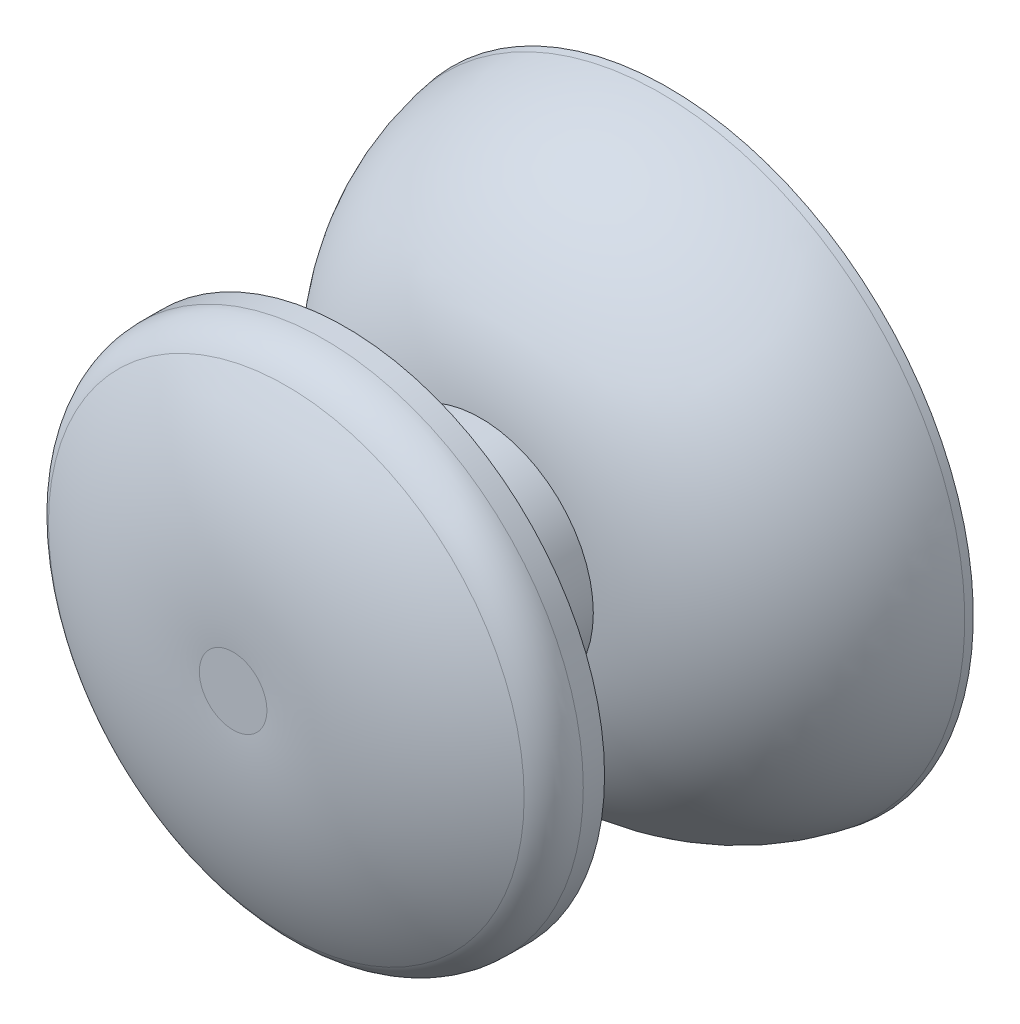
ISO-10303-21;
HEADER;
FILE_DESCRIPTION(('STEP AP214'),'2;1');
FILE_NAME('part.step','',(''),(''),'','','');
FILE_SCHEMA(('AUTOMOTIVE_DESIGN { 1 0 10303 214 1 1 1 1 }'));
ENDSEC;
DATA;
#1=APPLICATION_CONTEXT('core data for automotive mechanical design processes');
#2=APPLICATION_PROTOCOL_DEFINITION('international standard','automotive_design',2000,#1);
#3=PRODUCT_CONTEXT('',#1,'mechanical');
#4=PRODUCT('Part','Part','',(#3));
#5=PRODUCT_RELATED_PRODUCT_CATEGORY('part','',(#4));
#6=PRODUCT_DEFINITION_FORMATION('','',#4);
#7=PRODUCT_DEFINITION_CONTEXT('part definition',#1,'design');
#8=PRODUCT_DEFINITION('design','',#6,#7);
#9=PRODUCT_DEFINITION_SHAPE('','',#8);
#10=(LENGTH_UNIT() NAMED_UNIT(*) SI_UNIT(.MILLI.,.METRE.));
#11=(NAMED_UNIT(*) PLANE_ANGLE_UNIT() SI_UNIT($,.RADIAN.));
#12=(NAMED_UNIT(*) SI_UNIT($,.STERADIAN.) SOLID_ANGLE_UNIT());
#13=UNCERTAINTY_MEASURE_WITH_UNIT(LENGTH_MEASURE(1.E-05),#10,'distance_accuracy_value','');
#14=(GEOMETRIC_REPRESENTATION_CONTEXT(3) GLOBAL_UNCERTAINTY_ASSIGNED_CONTEXT((#13)) GLOBAL_UNIT_ASSIGNED_CONTEXT((#10,
#11,#12)) REPRESENTATION_CONTEXT('',''));
#15=CARTESIAN_POINT('',(0.,0.,0.));
#16=DIRECTION('',(0.,0.,1.));
#17=DIRECTION('',(1.,0.,0.));
#18=AXIS2_PLACEMENT_3D('',#15,#16,#17);
#19=CARTESIAN_POINT('',(55.2886051822846,12.3610868283743,18.2552883496559));
#20=DIRECTION('',(0.,0.,-1.));
#21=DIRECTION('',(-1.,0.,0.));
#22=AXIS2_PLACEMENT_3D('',#19,#20,#21);
#23=DEGENERATE_TOROIDAL_SURFACE('',#22,2.30270713318515,15.5154899332562,.T.);
#24=CARTESIAN_POINT('',(55.2886051822846,12.3610868283743,33.75));
#25=DIRECTION('',(0.,0.,-1.));
#26=DIRECTION('',(-1.,0.,0.));
#27=AXIS2_PLACEMENT_3D('',#24,#25,#26);
#28=CIRCLE('',#27,1.49999999999958);
#29=CARTESIAN_POINT('',(53.788605182285,12.3610868283743,33.75));
#30=VERTEX_POINT('',#29);
#31=EDGE_CURVE('E10',#30,#30,#28,.T.);
#32=ORIENTED_EDGE('',*,*,#31,.T.);
#33=EDGE_LOOP('',(#32));
#34=FACE_BOUND('',#33,.T.);
#35=CARTESIAN_POINT('',(55.2886051822846,12.3610868283743,31.3878518606448));
#36=DIRECTION('',(0.,0.,-1.));
#37=DIRECTION('',(-1.,0.,0.));
#38=AXIS2_PLACEMENT_3D('',#35,#36,#37);
#39=CIRCLE('',#38,10.5650435762754);
#40=CARTESIAN_POINT('',(44.7235616060092,12.3610868283743,31.3878518606448));
#41=VERTEX_POINT('',#40);
#42=EDGE_CURVE('E76',#41,#41,#39,.T.);
#43=ORIENTED_EDGE('',*,*,#42,.F.);
#44=EDGE_LOOP('',(#43));
#45=FACE_BOUND('',#44,.T.);
#46=ADVANCED_FACE('F33',(#34,#45),#23,.T.);
#47=CARTESIAN_POINT('',(56.7886051822842,12.3610868283743,33.75));
#48=DIRECTION('',(0.,0.,1.));
#49=DIRECTION('',(1.,0.,0.));
#50=AXIS2_PLACEMENT_3D('',#47,#48,#49);
#51=PLANE('',#50);
#52=ORIENTED_EDGE('',*,*,#31,.F.);
#53=EDGE_LOOP('',(#52));
#54=FACE_BOUND('',#53,.T.);
#55=ADVANCED_FACE('F84',(#54),#51,.T.);
#56=CARTESIAN_POINT('',(55.2886051822846,12.3610868283743,24.5842158486551));
#57=DIRECTION('',(0.,0.,-1.));
#58=DIRECTION('',(-1.,0.,0.));
#59=AXIS2_PLACEMENT_3D('',#56,#57,#58);
#60=PLANE('',#59);
#61=CARTESIAN_POINT('',(55.2886051822846,12.3610868283743,24.5842158486551));
#62=DIRECTION('',(0.,0.,-1.));
#63=DIRECTION('',(-1.,0.,0.));
#64=AXIS2_PLACEMENT_3D('',#61,#62,#63);
#65=CIRCLE('',#64,1.61377989283939);
#66=CARTESIAN_POINT('',(53.6748252894452,12.3610868283743,24.5842158486551));
#67=VERTEX_POINT('',#66);
#68=EDGE_CURVE('E39',#67,#67,#65,.T.);
#69=ORIENTED_EDGE('',*,*,#68,.T.);
#70=EDGE_LOOP('',(#69));
#71=FACE_BOUND('',#70,.T.);
#72=ADVANCED_FACE('F88',(#71),#60,.T.);
#73=CARTESIAN_POINT('',(55.2886051822846,12.3610868283743,33.7707782829122));
#74=DIRECTION('',(0.,0.,-1.));
#75=DIRECTION('',(-1.,0.,0.));
#76=AXIS2_PLACEMENT_3D('',#73,#74,#75);
#77=CYLINDRICAL_SURFACE('',#76,1.61377989283939);
#78=CARTESIAN_POINT('',(55.2886051822846,12.3610868283743,19.6671079243275));
#79=DIRECTION('',(0.,0.,-1.));
#80=DIRECTION('',(-1.,0.,0.));
#81=AXIS2_PLACEMENT_3D('',#78,#79,#80);
#82=CIRCLE('',#81,1.61377989283939);
#83=CARTESIAN_POINT('',(53.6748252894452,12.3610868283743,19.6671079243275));
#84=VERTEX_POINT('',#83);
#85=EDGE_CURVE('E43',#84,#84,#82,.T.);
#86=ORIENTED_EDGE('',*,*,#85,.T.);
#87=EDGE_LOOP('',(#86));
#88=FACE_BOUND('',#87,.T.);
#89=ORIENTED_EDGE('',*,*,#68,.F.);
#90=EDGE_LOOP('',(#89));
#91=FACE_BOUND('',#90,.T.);
#92=ADVANCED_FACE('F93',(#88,#91),#77,.F.);
#93=CARTESIAN_POINT('',(56.902385075124,12.3610868283743,19.6671079243275));
#94=DIRECTION('',(0.,0.,-1.));
#95=DIRECTION('',(-1.,0.,0.));
#96=AXIS2_PLACEMENT_3D('',#93,#94,#95);
#97=PLANE('',#96);
#98=CARTESIAN_POINT('',(55.2886051822846,12.3610868283743,19.6671079243275));
#99=DIRECTION('',(0.,0.,-1.));
#100=DIRECTION('',(-1.,0.,0.));
#101=AXIS2_PLACEMENT_3D('',#98,#99,#100);
#102=CIRCLE('',#101,8.82212376583157);
#103=CARTESIAN_POINT('',(46.466481416453,12.3610868283743,19.6671079243275));
#104=VERTEX_POINT('',#103);
#105=EDGE_CURVE('E47',#104,#104,#102,.T.);
#106=ORIENTED_EDGE('',*,*,#105,.T.);
#107=EDGE_LOOP('',(#106));
#108=FACE_BOUND('',#107,.T.);
#109=ORIENTED_EDGE('',*,*,#85,.F.);
#110=EDGE_LOOP('',(#109));
#111=FACE_BOUND('',#110,.T.);
#112=ADVANCED_FACE('F98',(#108,#111),#97,.T.);
#113=CARTESIAN_POINT('',(55.2886051822846,12.3610868283743,13.0193991709851));
#114=DIRECTION('',(0.,0.,-1.));
#115=DIRECTION('',(-1.,0.,0.));
#116=AXIS2_PLACEMENT_3D('',#113,#114,#115);
#117=DEGENERATE_TOROIDAL_SURFACE('',#116,3.85649333739738,8.29756091999675,.T.);
#118=CARTESIAN_POINT('',(55.2886051822846,12.3610868283743,14.75));
#119=DIRECTION('',(0.,0.,-1.));
#120=DIRECTION('',(-1.,0.,0.));
#121=AXIS2_PLACEMENT_3D('',#118,#119,#120);
#122=CIRCLE('',#121,11.9715742360496);
#123=CARTESIAN_POINT('',(43.317030946235,12.3610868283743,14.75));
#124=VERTEX_POINT('',#123);
#125=EDGE_CURVE('E52',#124,#124,#122,.T.);
#126=ORIENTED_EDGE('',*,*,#125,.T.);
#127=EDGE_LOOP('',(#126));
#128=FACE_BOUND('',#127,.T.);
#129=ORIENTED_EDGE('',*,*,#105,.F.);
#130=EDGE_LOOP('',(#129));
#131=FACE_BOUND('',#130,.T.);
#132=ADVANCED_FACE('F102',(#128,#131),#117,.F.);
#133=CARTESIAN_POINT('',(55.2886051822846,12.3610868283743,14.75));
#134=DIRECTION('',(0.,0.,-1.));
#135=DIRECTION('',(-1.,0.,0.));
#136=AXIS2_PLACEMENT_3D('',#133,#134,#135);
#137=CONICAL_SURFACE('',#136,11.9715742360496,0.210109931154276);
#138=CARTESIAN_POINT('',(55.2886051822846,12.3610868283743,14.42433044389));
#139=DIRECTION('',(0.,0.,-1.));
#140=DIRECTION('',(-1.,0.,0.));
#141=AXIS2_PLACEMENT_3D('',#138,#139,#140);
#142=CIRCLE('',#141,12.0410256698465);
#143=CARTESIAN_POINT('',(43.2475795124381,12.3610868283743,14.42433044389));
#144=VERTEX_POINT('',#143);
#145=EDGE_CURVE('E55',#144,#144,#142,.T.);
#146=ORIENTED_EDGE('',*,*,#145,.T.);
#147=EDGE_LOOP('',(#146));
#148=FACE_BOUND('',#147,.T.);
#149=ORIENTED_EDGE('',*,*,#125,.F.);
#150=EDGE_LOOP('',(#149));
#151=FACE_BOUND('',#150,.T.);
#152=ADVANCED_FACE('F106',(#148,#151),#137,.F.);
#153=CARTESIAN_POINT('',(67.3296308521311,12.3610868283743,14.42433044389));
#154=DIRECTION('',(0.,0.,-1.));
#155=DIRECTION('',(-1.,0.,0.));
#156=AXIS2_PLACEMENT_3D('',#153,#154,#155);
#157=PLANE('',#156);
#158=CARTESIAN_POINT('',(55.2886051822846,12.3610868283743,14.42433044389));
#159=DIRECTION('',(0.,0.,-1.));
#160=DIRECTION('',(-1.,0.,0.));
#161=AXIS2_PLACEMENT_3D('',#158,#159,#160);
#162=CIRCLE('',#161,13.5537477082164);
#163=CARTESIAN_POINT('',(41.7348574740682,12.3610868283743,14.42433044389));
#164=VERTEX_POINT('',#163);
#165=EDGE_CURVE('E58',#164,#164,#162,.T.);
#166=ORIENTED_EDGE('',*,*,#165,.T.);
#167=EDGE_LOOP('',(#166));
#168=FACE_BOUND('',#167,.T.);
#169=ORIENTED_EDGE('',*,*,#145,.F.);
#170=EDGE_LOOP('',(#169));
#171=FACE_BOUND('',#170,.T.);
#172=ADVANCED_FACE('F110',(#168,#171),#157,.T.);
#173=CARTESIAN_POINT('',(55.2886051822846,12.3610868283743,14.42433044389));
#174=DIRECTION('',(0.,0.,-1.));
#175=DIRECTION('',(-1.,0.,0.));
#176=AXIS2_PLACEMENT_3D('',#173,#174,#175);
#177=CONICAL_SURFACE('',#176,13.5537477082164,0.163563181067571);
#178=CARTESIAN_POINT('',(55.2886051822846,12.3610868283743,14.75));
#179=DIRECTION('',(0.,0.,-1.));
#180=DIRECTION('',(-1.,0.,0.));
#181=AXIS2_PLACEMENT_3D('',#178,#179,#180);
#182=CIRCLE('',#181,13.5);
#183=CARTESIAN_POINT('',(41.7886051822846,12.3610868283743,14.75));
#184=VERTEX_POINT('',#183);
#185=EDGE_CURVE('E61',#184,#184,#182,.T.);
#186=ORIENTED_EDGE('',*,*,#185,.T.);
#187=EDGE_LOOP('',(#186));
#188=FACE_BOUND('',#187,.T.);
#189=ORIENTED_EDGE('',*,*,#165,.F.);
#190=EDGE_LOOP('',(#189));
#191=FACE_BOUND('',#190,.T.);
#192=ADVANCED_FACE('F114',(#188,#191),#177,.T.);
#193=CARTESIAN_POINT('',(55.2886051822846,12.3610868283743,13.0193991709851));
#194=DIRECTION('',(0.,0.,-1.));
#195=DIRECTION('',(-1.,0.,0.));
#196=AXIS2_PLACEMENT_3D('',#193,#194,#195);
#197=DEGENERATE_TOROIDAL_SURFACE('',#196,3.85649333739738,9.79756091999665,.T.);
#198=CARTESIAN_POINT('',(55.2886051822846,12.3610868283743,22.7500000000002));
#199=DIRECTION('',(0.,0.,-1.));
#200=DIRECTION('',(-1.,0.,0.));
#201=AXIS2_PLACEMENT_3D('',#198,#199,#200);
#202=CIRCLE('',#201,5.00000000000002);
#203=CARTESIAN_POINT('',(50.2886051822846,12.3610868283743,22.7500000000002));
#204=VERTEX_POINT('',#203);
#205=EDGE_CURVE('E64',#204,#204,#202,.T.);
#206=ORIENTED_EDGE('',*,*,#205,.T.);
#207=EDGE_LOOP('',(#206));
#208=FACE_BOUND('',#207,.T.);
#209=ORIENTED_EDGE('',*,*,#185,.F.);
#210=EDGE_LOOP('',(#209));
#211=FACE_BOUND('',#210,.T.);
#212=ADVANCED_FACE('F118',(#208,#211),#197,.T.);
#213=CARTESIAN_POINT('',(55.2886051822846,12.3610868283743,33.7707782829122));
#214=DIRECTION('',(0.,0.,-1.));
#215=DIRECTION('',(-1.,0.,0.));
#216=AXIS2_PLACEMENT_3D('',#213,#214,#215);
#217=CYLINDRICAL_SURFACE('',#216,5.00000000000001);
#218=CARTESIAN_POINT('',(55.2886051822846,12.3610868283743,28.75));
#219=DIRECTION('',(0.,0.,-1.));
#220=DIRECTION('',(-1.,0.,0.));
#221=AXIS2_PLACEMENT_3D('',#218,#219,#220);
#222=CIRCLE('',#221,5.);
#223=CARTESIAN_POINT('',(50.2886051822846,12.3610868283743,28.75));
#224=VERTEX_POINT('',#223);
#225=EDGE_CURVE('E67',#224,#224,#222,.T.);
#226=ORIENTED_EDGE('',*,*,#225,.T.);
#227=EDGE_LOOP('',(#226));
#228=FACE_BOUND('',#227,.T.);
#229=ORIENTED_EDGE('',*,*,#205,.F.);
#230=EDGE_LOOP('',(#229));
#231=FACE_BOUND('',#230,.T.);
#232=ADVANCED_FACE('F122',(#228,#231),#217,.T.);
#233=CARTESIAN_POINT('',(60.2886051822846,12.3610868283743,28.75));
#234=DIRECTION('',(0.,0.,-1.));
#235=DIRECTION('',(-1.,0.,0.));
#236=AXIS2_PLACEMENT_3D('',#233,#234,#235);
#237=PLANE('',#236);
#238=CARTESIAN_POINT('',(55.2886051822846,12.3610868283743,28.75));
#239=DIRECTION('',(0.,0.,-1.));
#240=DIRECTION('',(-1.,0.,0.));
#241=AXIS2_PLACEMENT_3D('',#238,#239,#240);
#242=CIRCLE('',#241,11.5);
#243=CARTESIAN_POINT('',(43.7886051822846,12.3610868283743,28.75));
#244=VERTEX_POINT('',#243);
#245=EDGE_CURVE('E70',#244,#244,#242,.T.);
#246=ORIENTED_EDGE('',*,*,#245,.T.);
#247=EDGE_LOOP('',(#246));
#248=FACE_BOUND('',#247,.T.);
#249=ORIENTED_EDGE('',*,*,#225,.F.);
#250=EDGE_LOOP('',(#249));
#251=FACE_BOUND('',#250,.T.);
#252=ADVANCED_FACE('F126',(#248,#251),#237,.T.);
#253=CARTESIAN_POINT('',(55.2886051822846,12.3610868283743,33.7707782829122));
#254=DIRECTION('',(0.,0.,-1.));
#255=DIRECTION('',(-1.,0.,0.));
#256=AXIS2_PLACEMENT_3D('',#253,#254,#255);
#257=CYLINDRICAL_SURFACE('',#256,11.5);
#258=CARTESIAN_POINT('',(55.2886051822846,12.3610868283743,29.6950192697976));
#259=DIRECTION('',(0.,0.,-1.));
#260=DIRECTION('',(-1.,0.,0.));
#261=AXIS2_PLACEMENT_3D('',#258,#259,#260);
#262=CIRCLE('',#261,11.5);
#263=CARTESIAN_POINT('',(43.7886051822846,12.3610868283743,29.6950192697976));
#264=VERTEX_POINT('',#263);
#265=EDGE_CURVE('E73',#264,#264,#262,.T.);
#266=ORIENTED_EDGE('',*,*,#265,.T.);
#267=EDGE_LOOP('',(#266));
#268=FACE_BOUND('',#267,.T.);
#269=ORIENTED_EDGE('',*,*,#245,.F.);
#270=EDGE_LOOP('',(#269));
#271=FACE_BOUND('',#270,.T.);
#272=ADVANCED_FACE('F130',(#268,#271),#257,.T.);
#273=CARTESIAN_POINT('',(55.2886051822846,12.3610868283743,29.6950192697976));
#274=DIRECTION('',(0.,0.,-1.));
#275=DIRECTION('',(-1.,0.,0.));
#276=AXIS2_PLACEMENT_3D('',#273,#274,#275);
#277=TOROIDAL_SURFACE('',#276,9.5,2.00000000000001);
#278=ORIENTED_EDGE('',*,*,#42,.T.);
#279=EDGE_LOOP('',(#278));
#280=FACE_BOUND('',#279,.T.);
#281=ORIENTED_EDGE('',*,*,#265,.F.);
#282=EDGE_LOOP('',(#281));
#283=FACE_BOUND('',#282,.T.);
#284=ADVANCED_FACE('F80',(#280,#283),#277,.T.);
#285=CLOSED_SHELL('',(#46,#55,#72,#92,#112,#132,#152,#172,#192,#212,#232,#252,#272,#284));
#286=MANIFOLD_SOLID_BREP('B2',#285);
#287=ADVANCED_BREP_SHAPE_REPRESENTATION('',(#18,#286),#14);
#288=SHAPE_DEFINITION_REPRESENTATION(#9,#287);
ENDSEC;
END-ISO-10303-21;
